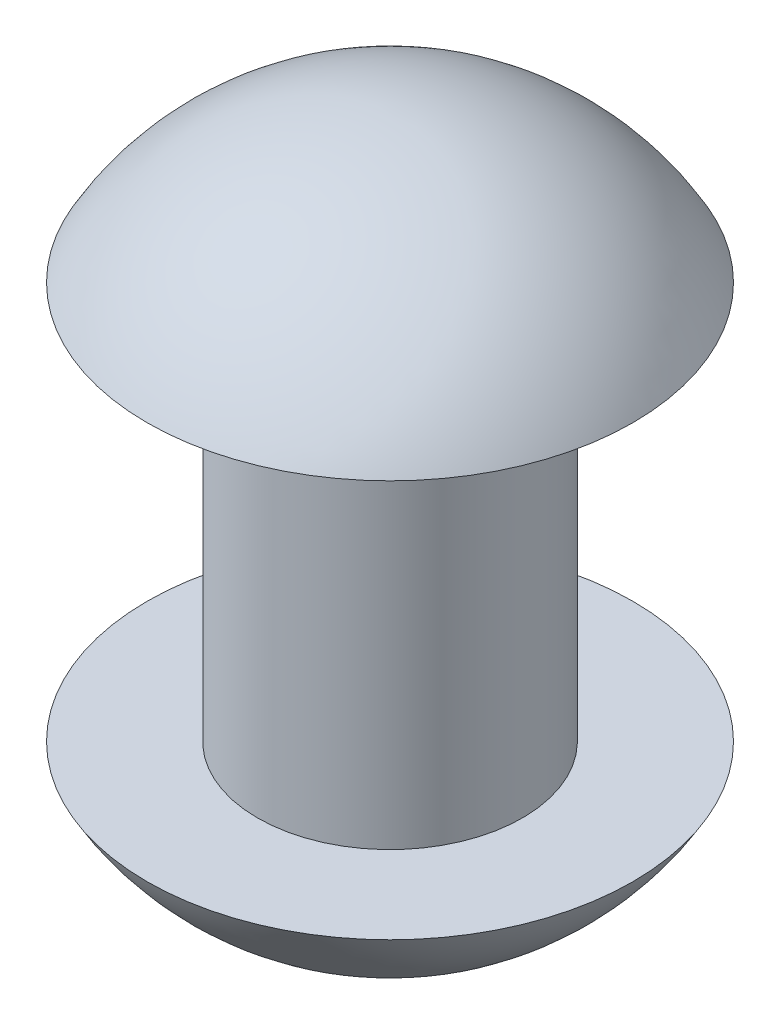
ISO-10303-21;
HEADER;
FILE_DESCRIPTION(('STEP AP214'),'2;1');
FILE_NAME('part.step','',(''),(''),'','','');
FILE_SCHEMA(('AUTOMOTIVE_DESIGN { 1 0 10303 214 1 1 1 1 }'));
ENDSEC;
DATA;
#1=APPLICATION_CONTEXT('core data for automotive mechanical design processes');
#2=APPLICATION_PROTOCOL_DEFINITION('international standard','automotive_design',2000,#1);
#3=PRODUCT_CONTEXT('',#1,'mechanical');
#4=PRODUCT('Part','Part','',(#3));
#5=PRODUCT_RELATED_PRODUCT_CATEGORY('part','',(#4));
#6=PRODUCT_DEFINITION_FORMATION('','',#4);
#7=PRODUCT_DEFINITION_CONTEXT('part definition',#1,'design');
#8=PRODUCT_DEFINITION('design','',#6,#7);
#9=PRODUCT_DEFINITION_SHAPE('','',#8);
#10=(LENGTH_UNIT() NAMED_UNIT(*) SI_UNIT(.MILLI.,.METRE.));
#11=(NAMED_UNIT(*) PLANE_ANGLE_UNIT() SI_UNIT($,.RADIAN.));
#12=(NAMED_UNIT(*) SI_UNIT($,.STERADIAN.) SOLID_ANGLE_UNIT());
#13=UNCERTAINTY_MEASURE_WITH_UNIT(LENGTH_MEASURE(1.E-05),#10,'distance_accuracy_value','');
#14=(GEOMETRIC_REPRESENTATION_CONTEXT(3) GLOBAL_UNCERTAINTY_ASSIGNED_CONTEXT((#13)) GLOBAL_UNIT_ASSIGNED_CONTEXT((#10,
#11,#12)) REPRESENTATION_CONTEXT('',''));
#15=CARTESIAN_POINT('',(0.,0.,0.));
#16=DIRECTION('',(0.,0.,1.));
#17=DIRECTION('',(1.,0.,0.));
#18=AXIS2_PLACEMENT_3D('',#15,#16,#17);
#19=CARTESIAN_POINT('',(-0.12,0.,0.));
#20=DIRECTION('',(0.,1.,0.));
#21=DIRECTION('',(0.,0.,1.));
#22=AXIS2_PLACEMENT_3D('',#19,#20,#21);
#23=PLANE('',#22);
#24=CARTESIAN_POINT('',(0.,0.,0.));
#25=DIRECTION('',(0.,1.,0.));
#26=DIRECTION('',(0.,0.,1.));
#27=AXIS2_PLACEMENT_3D('',#24,#25,#26);
#28=CIRCLE('',#27,0.22);
#29=CARTESIAN_POINT('',(0.,0.,0.22));
#30=VERTEX_POINT('',#29);
#31=EDGE_CURVE('E10',#30,#30,#28,.T.);
#32=ORIENTED_EDGE('',*,*,#31,.T.);
#33=EDGE_LOOP('',(#32));
#34=FACE_BOUND('',#33,.T.);
#35=CARTESIAN_POINT('',(0.,0.,0.));
#36=DIRECTION('',(0.,1.,0.));
#37=DIRECTION('',(0.,0.,1.));
#38=AXIS2_PLACEMENT_3D('',#35,#36,#37);
#39=CIRCLE('',#38,0.12);
#40=CARTESIAN_POINT('',(0.,0.,0.12));
#41=VERTEX_POINT('',#40);
#42=EDGE_CURVE('E46',#41,#41,#39,.T.);
#43=ORIENTED_EDGE('',*,*,#42,.F.);
#44=EDGE_LOOP('',(#43));
#45=FACE_BOUND('',#44,.T.);
#46=ADVANCED_FACE('F32',(#34,#45),#23,.T.);
#47=CARTESIAN_POINT('',(0.,0.123196023754803,0.));
#48=DIRECTION('',(0.,1.,0.));
#49=DIRECTION('',(-1.,0.,0.));
#50=AXIS2_PLACEMENT_3D('',#47,#48,#49);
#51=SPHERICAL_SURFACE('',#50,0.25214531577841);
#52=ORIENTED_EDGE('',*,*,#31,.F.);
#53=EDGE_LOOP('',(#52));
#54=FACE_BOUND('',#53,.T.);
#55=ADVANCED_FACE('F55',(#54),#51,.T.);
#56=CARTESIAN_POINT('',(0.,0.236803976245197,0.));
#57=DIRECTION('',(0.,1.,0.));
#58=DIRECTION('',(-1.,0.,0.));
#59=AXIS2_PLACEMENT_3D('',#56,#57,#58);
#60=SPHERICAL_SURFACE('',#59,0.25214531577841);
#61=CARTESIAN_POINT('',(0.,0.36,0.));
#62=DIRECTION('',(0.,1.,0.));
#63=DIRECTION('',(0.,0.,1.));
#64=AXIS2_PLACEMENT_3D('',#61,#62,#63);
#65=CIRCLE('',#64,0.22);
#66=CARTESIAN_POINT('',(0.,0.36,0.22));
#67=VERTEX_POINT('',#66);
#68=EDGE_CURVE('E38',#67,#67,#65,.T.);
#69=ORIENTED_EDGE('',*,*,#68,.T.);
#70=EDGE_LOOP('',(#69));
#71=FACE_BOUND('',#70,.T.);
#72=ADVANCED_FACE('F59',(#71),#60,.T.);
#73=CARTESIAN_POINT('',(-0.12,0.36,0.));
#74=DIRECTION('',(0.,1.,0.));
#75=DIRECTION('',(0.,0.,1.));
#76=AXIS2_PLACEMENT_3D('',#73,#74,#75);
#77=PLANE('',#76);
#78=ORIENTED_EDGE('',*,*,#68,.F.);
#79=EDGE_LOOP('',(#78));
#80=FACE_BOUND('',#79,.T.);
#81=CARTESIAN_POINT('',(0.,0.36,0.));
#82=DIRECTION('',(0.,1.,0.));
#83=DIRECTION('',(0.,0.,1.));
#84=AXIS2_PLACEMENT_3D('',#81,#82,#83);
#85=CIRCLE('',#84,0.12);
#86=CARTESIAN_POINT('',(0.,0.36,0.12));
#87=VERTEX_POINT('',#86);
#88=EDGE_CURVE('E42',#87,#87,#85,.T.);
#89=ORIENTED_EDGE('',*,*,#88,.T.);
#90=EDGE_LOOP('',(#89));
#91=FACE_BOUND('',#90,.T.);
#92=ADVANCED_FACE('F64',(#80,#91),#77,.F.);
#93=CARTESIAN_POINT('',(0.,0.488949292023607,0.));
#94=DIRECTION('',(0.,1.,0.));
#95=DIRECTION('',(0.,0.,1.));
#96=AXIS2_PLACEMENT_3D('',#93,#94,#95);
#97=CYLINDRICAL_SURFACE('',#96,0.12);
#98=ORIENTED_EDGE('',*,*,#88,.F.);
#99=EDGE_LOOP('',(#98));
#100=FACE_BOUND('',#99,.T.);
#101=ORIENTED_EDGE('',*,*,#42,.T.);
#102=EDGE_LOOP('',(#101));
#103=FACE_BOUND('',#102,.T.);
#104=ADVANCED_FACE('F52',(#100,#103),#97,.T.);
#105=CLOSED_SHELL('',(#46,#55,#72,#92,#104));
#106=MANIFOLD_SOLID_BREP('B2',#105);
#107=ADVANCED_BREP_SHAPE_REPRESENTATION('',(#18,#106),#14);
#108=SHAPE_DEFINITION_REPRESENTATION(#9,#107);
ENDSEC;
END-ISO-10303-21;
